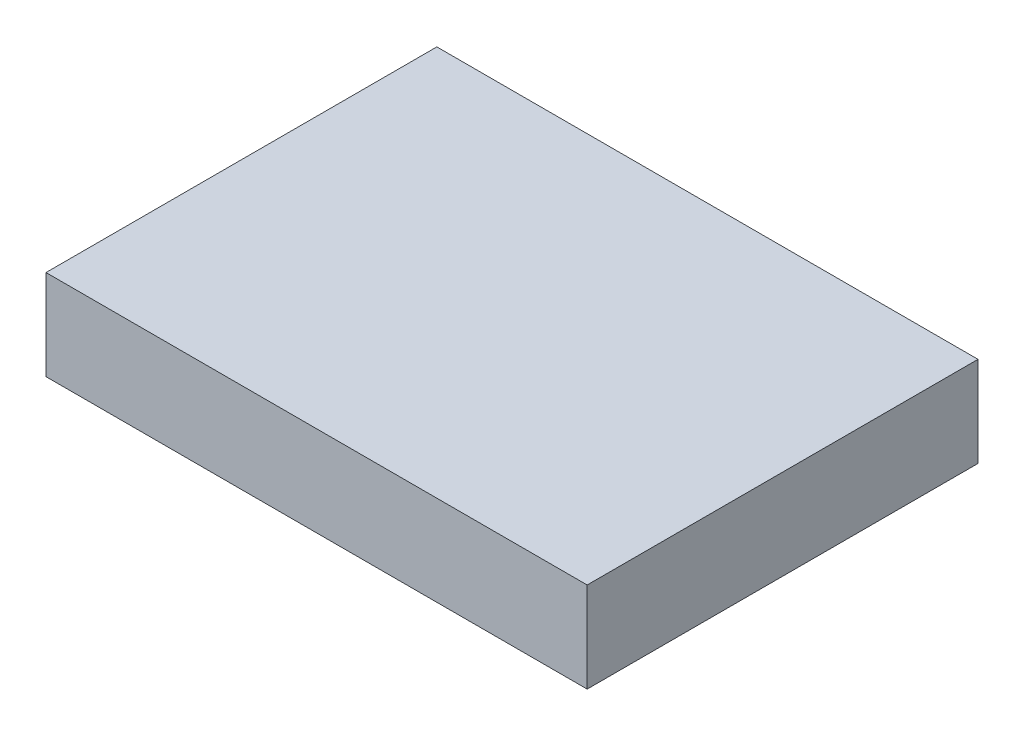
ISO-10303-21;
HEADER;
FILE_DESCRIPTION(('STEP AP214'),'2;1');
FILE_NAME('part.step','',(''),(''),'','','');
FILE_SCHEMA(('AUTOMOTIVE_DESIGN { 1 0 10303 214 1 1 1 1 }'));
ENDSEC;
DATA;
#1=APPLICATION_CONTEXT('core data for automotive mechanical design processes');
#2=APPLICATION_PROTOCOL_DEFINITION('international standard','automotive_design',2000,#1);
#3=PRODUCT_CONTEXT('',#1,'mechanical');
#4=PRODUCT('Part','Part','',(#3));
#5=PRODUCT_RELATED_PRODUCT_CATEGORY('part','',(#4));
#6=PRODUCT_DEFINITION_FORMATION('','',#4);
#7=PRODUCT_DEFINITION_CONTEXT('part definition',#1,'design');
#8=PRODUCT_DEFINITION('design','',#6,#7);
#9=PRODUCT_DEFINITION_SHAPE('','',#8);
#10=(LENGTH_UNIT() NAMED_UNIT(*) SI_UNIT(.MILLI.,.METRE.));
#11=(NAMED_UNIT(*) PLANE_ANGLE_UNIT() SI_UNIT($,.RADIAN.));
#12=(NAMED_UNIT(*) SI_UNIT($,.STERADIAN.) SOLID_ANGLE_UNIT());
#13=UNCERTAINTY_MEASURE_WITH_UNIT(LENGTH_MEASURE(1.E-05),#10,'distance_accuracy_value','');
#14=(GEOMETRIC_REPRESENTATION_CONTEXT(3) GLOBAL_UNCERTAINTY_ASSIGNED_CONTEXT((#13)) GLOBAL_UNIT_ASSIGNED_CONTEXT((#10,
#11,#12)) REPRESENTATION_CONTEXT('',''));
#15=CARTESIAN_POINT('',(0.,0.,0.));
#16=DIRECTION('',(0.,0.,1.));
#17=DIRECTION('',(1.,0.,0.));
#18=AXIS2_PLACEMENT_3D('',#15,#16,#17);
#19=CARTESIAN_POINT('',(0.,30.,0.));
#20=DIRECTION('',(1.,0.,0.));
#21=DIRECTION('',(0.,0.,-1.));
#22=AXIS2_PLACEMENT_3D('',#19,#20,#21);
#23=PLANE('',#22);
#24=DIRECTION('',(0.,0.,1.));
#25=VECTOR('',#24,1.);
#26=CARTESIAN_POINT('',(0.,0.,0.));
#27=LINE('',#26,#25);
#28=CARTESIAN_POINT('',(0.,0.,-130.));
#29=VERTEX_POINT('',#28);
#30=CARTESIAN_POINT('',(0.,0.,0.));
#31=VERTEX_POINT('',#30);
#32=EDGE_CURVE('E76',#29,#31,#27,.T.);
#33=ORIENTED_EDGE('',*,*,#32,.T.);
#34=DIRECTION('',(0.,-1.,0.));
#35=VECTOR('',#34,1.);
#36=CARTESIAN_POINT('',(0.,30.,0.));
#37=LINE('',#36,#35);
#38=CARTESIAN_POINT('',(0.,30.,0.));
#39=VERTEX_POINT('',#38);
#40=EDGE_CURVE('E11',#39,#31,#37,.T.);
#41=ORIENTED_EDGE('',*,*,#40,.F.);
#42=DIRECTION('',(0.,0.,1.));
#43=VECTOR('',#42,1.);
#44=CARTESIAN_POINT('',(0.,30.,0.));
#45=LINE('',#44,#43);
#46=CARTESIAN_POINT('',(0.,30.,-130.));
#47=VERTEX_POINT('',#46);
#48=EDGE_CURVE('E94',#47,#39,#45,.T.);
#49=ORIENTED_EDGE('',*,*,#48,.F.);
#50=DIRECTION('',(0.,-1.,0.));
#51=VECTOR('',#50,1.);
#52=CARTESIAN_POINT('',(0.,30.,-130.));
#53=LINE('',#52,#51);
#54=EDGE_CURVE('E88',#47,#29,#53,.T.);
#55=ORIENTED_EDGE('',*,*,#54,.T.);
#56=EDGE_LOOP('',(#33,#41,#49,#55));
#57=FACE_BOUND('',#56,.T.);
#58=ADVANCED_FACE('F32',(#57),#23,.F.);
#59=CARTESIAN_POINT('',(0.,30.,0.));
#60=DIRECTION('',(0.,0.,-1.));
#61=DIRECTION('',(-1.,0.,0.));
#62=AXIS2_PLACEMENT_3D('',#59,#60,#61);
#63=PLANE('',#62);
#64=DIRECTION('',(1.,0.,0.));
#65=VECTOR('',#64,1.);
#66=CARTESIAN_POINT('',(0.,0.,0.));
#67=LINE('',#66,#65);
#68=CARTESIAN_POINT('',(180.,0.,0.));
#69=VERTEX_POINT('',#68);
#70=EDGE_CURVE('E72',#31,#69,#67,.T.);
#71=ORIENTED_EDGE('',*,*,#70,.T.);
#72=DIRECTION('',(0.,-1.,0.));
#73=VECTOR('',#72,1.);
#74=CARTESIAN_POINT('',(180.,30.,0.));
#75=LINE('',#74,#73);
#76=CARTESIAN_POINT('',(180.,30.,0.));
#77=VERTEX_POINT('',#76);
#78=EDGE_CURVE('E39',#77,#69,#75,.T.);
#79=ORIENTED_EDGE('',*,*,#78,.F.);
#80=DIRECTION('',(1.,0.,0.));
#81=VECTOR('',#80,1.);
#82=CARTESIAN_POINT('',(0.,30.,0.));
#83=LINE('',#82,#81);
#84=EDGE_CURVE('E84',#39,#77,#83,.T.);
#85=ORIENTED_EDGE('',*,*,#84,.F.);
#86=ORIENTED_EDGE('',*,*,#40,.T.);
#87=EDGE_LOOP('',(#71,#79,#85,#86));
#88=FACE_BOUND('',#87,.T.);
#89=ADVANCED_FACE('F83',(#88),#63,.F.);
#90=CARTESIAN_POINT('',(180.,30.,0.));
#91=DIRECTION('',(-1.,0.,0.));
#92=DIRECTION('',(0.,0.,1.));
#93=AXIS2_PLACEMENT_3D('',#90,#91,#92);
#94=PLANE('',#93);
#95=DIRECTION('',(0.,0.,-1.));
#96=VECTOR('',#95,1.);
#97=CARTESIAN_POINT('',(180.,0.,0.));
#98=LINE('',#97,#96);
#99=CARTESIAN_POINT('',(180.,0.,-130.));
#100=VERTEX_POINT('',#99);
#101=EDGE_CURVE('E77',#69,#100,#98,.T.);
#102=ORIENTED_EDGE('',*,*,#101,.T.);
#103=DIRECTION('',(0.,-1.,0.));
#104=VECTOR('',#103,1.);
#105=CARTESIAN_POINT('',(180.,30.,-130.));
#106=LINE('',#105,#104);
#107=CARTESIAN_POINT('',(180.,30.,-130.));
#108=VERTEX_POINT('',#107);
#109=EDGE_CURVE('E100',#108,#100,#106,.T.);
#110=ORIENTED_EDGE('',*,*,#109,.F.);
#111=DIRECTION('',(0.,0.,-1.));
#112=VECTOR('',#111,1.);
#113=CARTESIAN_POINT('',(180.,30.,0.));
#114=LINE('',#113,#112);
#115=EDGE_CURVE('E51',#77,#108,#114,.T.);
#116=ORIENTED_EDGE('',*,*,#115,.F.);
#117=ORIENTED_EDGE('',*,*,#78,.T.);
#118=EDGE_LOOP('',(#102,#110,#116,#117));
#119=FACE_BOUND('',#118,.T.);
#120=ADVANCED_FACE('F103',(#119),#94,.F.);
#121=CARTESIAN_POINT('',(0.,30.,-130.));
#122=DIRECTION('',(0.,0.,1.));
#123=DIRECTION('',(1.,0.,0.));
#124=AXIS2_PLACEMENT_3D('',#121,#122,#123);
#125=PLANE('',#124);
#126=DIRECTION('',(-1.,0.,0.));
#127=VECTOR('',#126,1.);
#128=CARTESIAN_POINT('',(0.,0.,-130.));
#129=LINE('',#128,#127);
#130=EDGE_CURVE('E92',#100,#29,#129,.T.);
#131=ORIENTED_EDGE('',*,*,#130,.T.);
#132=ORIENTED_EDGE('',*,*,#54,.F.);
#133=DIRECTION('',(-1.,0.,0.));
#134=VECTOR('',#133,1.);
#135=CARTESIAN_POINT('',(0.,30.,-130.));
#136=LINE('',#135,#134);
#137=EDGE_CURVE('E46',#108,#47,#136,.T.);
#138=ORIENTED_EDGE('',*,*,#137,.F.);
#139=ORIENTED_EDGE('',*,*,#109,.T.);
#140=EDGE_LOOP('',(#131,#132,#138,#139));
#141=FACE_BOUND('',#140,.T.);
#142=ADVANCED_FACE('F105',(#141),#125,.F.);
#143=CARTESIAN_POINT('',(0.,30.,-130.));
#144=DIRECTION('',(0.,-1.,0.));
#145=DIRECTION('',(0.,0.,-1.));
#146=AXIS2_PLACEMENT_3D('',#143,#144,#145);
#147=PLANE('',#146);
#148=ORIENTED_EDGE('',*,*,#48,.T.);
#149=ORIENTED_EDGE('',*,*,#84,.T.);
#150=ORIENTED_EDGE('',*,*,#115,.T.);
#151=ORIENTED_EDGE('',*,*,#137,.T.);
#152=EDGE_LOOP('',(#148,#149,#150,#151));
#153=FACE_BOUND('',#152,.T.);
#154=ADVANCED_FACE('F106',(#153),#147,.F.);
#155=CARTESIAN_POINT('',(0.,0.,-130.));
#156=DIRECTION('',(0.,-1.,0.));
#157=DIRECTION('',(0.,0.,-1.));
#158=AXIS2_PLACEMENT_3D('',#155,#156,#157);
#159=PLANE('',#158);
#160=ORIENTED_EDGE('',*,*,#32,.F.);
#161=ORIENTED_EDGE('',*,*,#130,.F.);
#162=ORIENTED_EDGE('',*,*,#101,.F.);
#163=ORIENTED_EDGE('',*,*,#70,.F.);
#164=EDGE_LOOP('',(#160,#161,#162,#163));
#165=FACE_BOUND('',#164,.T.);
#166=ADVANCED_FACE('F73',(#165),#159,.T.);
#167=CLOSED_SHELL('',(#58,#89,#120,#142,#154,#166));
#168=MANIFOLD_SOLID_BREP('B2',#167);
#169=ADVANCED_BREP_SHAPE_REPRESENTATION('',(#18,#168),#14);
#170=SHAPE_DEFINITION_REPRESENTATION(#9,#169);
ENDSEC;
END-ISO-10303-21;
